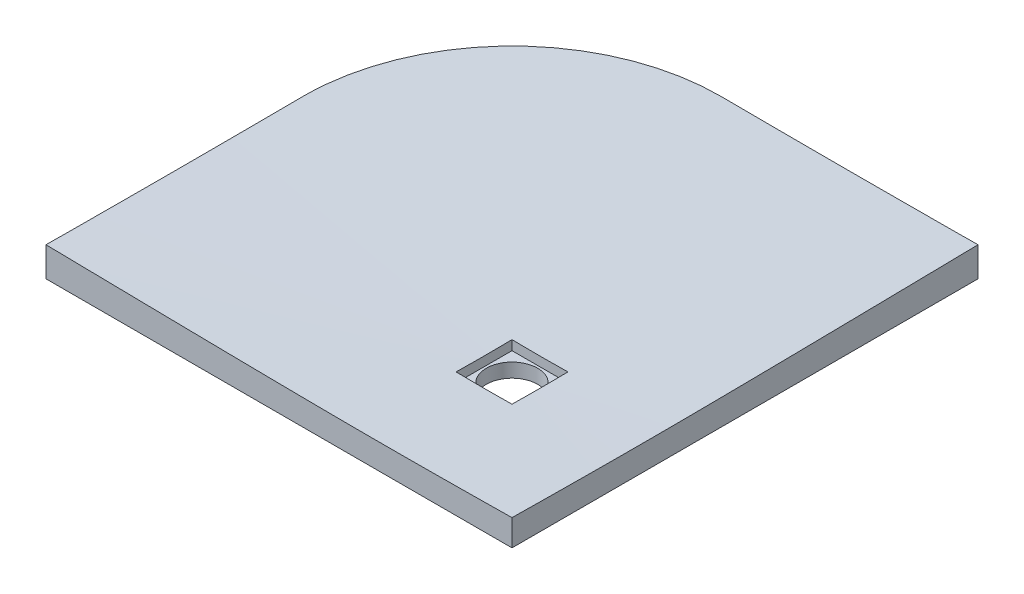
ISO-10303-21;
HEADER;
FILE_DESCRIPTION(('STEP AP214'),'2;1');
FILE_NAME('part.step','',(''),(''),'','','');
FILE_SCHEMA(('AUTOMOTIVE_DESIGN { 1 0 10303 214 1 1 1 1 }'));
ENDSEC;
DATA;
#1=APPLICATION_CONTEXT('core data for automotive mechanical design processes');
#2=APPLICATION_PROTOCOL_DEFINITION('international standard','automotive_design',2000,#1);
#3=PRODUCT_CONTEXT('',#1,'mechanical');
#4=PRODUCT('Part','Part','',(#3));
#5=PRODUCT_RELATED_PRODUCT_CATEGORY('part','',(#4));
#6=PRODUCT_DEFINITION_FORMATION('','',#4);
#7=PRODUCT_DEFINITION_CONTEXT('part definition',#1,'design');
#8=PRODUCT_DEFINITION('design','',#6,#7);
#9=PRODUCT_DEFINITION_SHAPE('','',#8);
#10=(LENGTH_UNIT() NAMED_UNIT(*) SI_UNIT(.MILLI.,.METRE.));
#11=(NAMED_UNIT(*) PLANE_ANGLE_UNIT() SI_UNIT($,.RADIAN.));
#12=(NAMED_UNIT(*) SI_UNIT($,.STERADIAN.) SOLID_ANGLE_UNIT());
#13=UNCERTAINTY_MEASURE_WITH_UNIT(LENGTH_MEASURE(1.E-05),#10,'distance_accuracy_value','');
#14=(GEOMETRIC_REPRESENTATION_CONTEXT(3) GLOBAL_UNCERTAINTY_ASSIGNED_CONTEXT((#13)) GLOBAL_UNIT_ASSIGNED_CONTEXT((#10,
#11,#12)) REPRESENTATION_CONTEXT('',''));
#15=CARTESIAN_POINT('',(0.,0.,0.));
#16=DIRECTION('',(0.,0.,1.));
#17=DIRECTION('',(1.,0.,0.));
#18=AXIS2_PLACEMENT_3D('',#15,#16,#17);
#19=CARTESIAN_POINT('',(223.5,-70.,223.5));
#20=DIRECTION('',(0.,1.,0.));
#21=DIRECTION('',(0.,0.,1.));
#22=AXIS2_PLACEMENT_3D('',#19,#20,#21);
#23=CYLINDRICAL_SURFACE('',#22,55.0000000000001);
#24=CARTESIAN_POINT('',(223.5,-70.,223.5));
#25=DIRECTION('',(0.,1.,0.));
#26=DIRECTION('',(0.,0.,1.));
#27=AXIS2_PLACEMENT_3D('',#24,#25,#26);
#28=CIRCLE('',#27,55.0000000000001);
#29=CARTESIAN_POINT('',(223.5,-70.,278.5));
#30=VERTEX_POINT('',#29);
#31=EDGE_CURVE('E177',#30,#30,#28,.T.);
#32=ORIENTED_EDGE('',*,*,#31,.F.);
#33=EDGE_LOOP('',(#32));
#34=FACE_BOUND('',#33,.T.);
#35=CARTESIAN_POINT('',(223.5,-40.,223.5));
#36=DIRECTION('',(0.,1.,0.));
#37=DIRECTION('',(0.,0.,1.));
#38=AXIS2_PLACEMENT_3D('',#35,#36,#37);
#39=CIRCLE('',#38,55.0000000000001);
#40=CARTESIAN_POINT('',(223.5,-40.,278.5));
#41=VERTEX_POINT('',#40);
#42=EDGE_CURVE('E67',#41,#41,#39,.F.);
#43=ORIENTED_EDGE('',*,*,#42,.F.);
#44=EDGE_LOOP('',(#43));
#45=FACE_BOUND('',#44,.T.);
#46=ADVANCED_FACE('F62',(#34,#45),#23,.F.);
#47=CARTESIAN_POINT('',(268.892086228115,-20.,254.557342253634));
#48=CARTESIAN_POINT('',(793.797325696511,0.,1200.38604865162));
#49=CARTESIAN_POINT('',(331.006770735383,-20.,163.773169797404));
#50=CARTESIAN_POINT('',(2747.56942299976,0.,59.7913972586013));
#51=CARTESIAN_POINT('',(240.222598279153,-20.,101.658485290136));
#52=CARTESIAN_POINT('',(1606.97477160673,0.,-1893.98070004464));
#53=CARTESIAN_POINT('',(178.107913771885,-20.,192.442657746366));
#54=CARTESIAN_POINT('',(-346.797325696511,0.,-753.386048651623));
#55=CARTESIAN_POINT('',(115.993229264616,-20.,283.226830202596));
#56=CARTESIAN_POINT('',(-2300.56942299976,0.,387.208602741399));
#57=CARTESIAN_POINT('',(206.777401720846,-20.,345.341514709864));
#58=CARTESIAN_POINT('',(-1159.97477160673,0.,2340.98070004465));
#59=CARTESIAN_POINT('',(268.892086228115,-20.,254.557342253634));
#60=CARTESIAN_POINT('',(793.797325696511,0.,1200.38604865162));
#61=(BOUNDED_SURFACE() B_SPLINE_SURFACE(3,1,((#47,#48),(#49,#50),(#51,#52),(#53,#54),(#55,#56),
(#57,#58),(#59,#60)),.UNSPECIFIED.,.T.,.F.,.F.) B_SPLINE_SURFACE_WITH_KNOTS((4,3,4),(2,2),(0.,
0.5,1.),(0.,1.),.UNSPECIFIED.) GEOMETRIC_REPRESENTATION_ITEM() RATIONAL_B_SPLINE_SURFACE(((1.,
1.),(0.333333333333333,0.333333333333333),(0.333333333333333,0.333333333333333),(1.,1.),
(0.333333333333333,0.333333333333333),(0.333333333333333,0.333333333333333),(1.,1.))) REPRESENTATION_ITEM('') SURFACE());
#62=CARTESIAN_POINT('',(500.,-6.5961327024955,-500.));
#63=CARTESIAN_POINT('',(486.112062479628,-6.68785544661228,-500.));
#64=CARTESIAN_POINT('',(472.224084380555,-6.77352997391001,-500.));
#65=CARTESIAN_POINT('',(444.448051283156,-6.93215513674839,-500.));
#66=CARTESIAN_POINT('',(430.559996284806,-7.00510576832152,-500.));
#67=CARTESIAN_POINT('',(402.783821204437,-7.13765562887392,-500.));
#68=CARTESIAN_POINT('',(388.895701122413,-7.19725485679232,-500.));
#69=CARTESIAN_POINT('',(361.119414194405,-7.30257320450082,-500.));
#70=CARTESIAN_POINT('',(347.231247348445,-7.3482923302907,-500.));
#71=CARTESIAN_POINT('',(319.454875024604,-7.42542208353765,-500.));
#72=CARTESIAN_POINT('',(305.566669546727,-7.45683271226499,-500.));
#73=CARTESIAN_POINT('',(277.790233703281,-7.50504175919853,-500.));
#74=CARTESIAN_POINT('',(263.902003337713,-7.52184017798842,-500.));
#75=CARTESIAN_POINT('',(236.125514443605,-7.5406586477661,-500.));
#76=CARTESIAN_POINT('',(222.237255915052,-7.54267867947611,-500.));
#77=CARTESIAN_POINT('',(194.460743949835,-7.53192020342901,-500.));
#78=CARTESIAN_POINT('',(180.572490513172,-7.5191416949685,-500.));
#79=CARTESIAN_POINT('',(152.796005033548,-7.47891292460756,-500.));
#80=CARTESIAN_POINT('',(138.907772990586,-7.45146266278969,-500.));
#81=CARTESIAN_POINT('',(111.131349915833,-7.38215803046327,-500.));
#82=CARTESIAN_POINT('',(97.2431588840283,-7.34030366508078,-500.));
#83=CARTESIAN_POINT('',(69.4668262477322,-7.24258604962675,-500.));
#84=CARTESIAN_POINT('',(55.5786846432405,-7.18672279959748,-500.));
#85=CARTESIAN_POINT('',(27.8024628477503,-7.06149421164214,-500.));
#86=CARTESIAN_POINT('',(13.9143826567512,-6.99212887388099,-500.));
#87=CARTESIAN_POINT('',(-20.8086634654984,-6.8025596210081,-500.));
#88=CARTESIAN_POINT('',(-41.643585640806,-6.67428166754999,-500.));
#89=CARTESIAN_POINT('',(-83.3132496020889,-6.39093430234656,-500.));
#90=CARTESIAN_POINT('',(-104.147991388034,-6.23586488624339,-500.));
#91=CARTESIAN_POINT('',(-145.817296838781,-5.9013836292213,-500.));
#92=CARTESIAN_POINT('',(-166.651860503412,-5.72197176716899,-500.));
#93=CARTESIAN_POINT('',(-208.320785646058,-5.34127657340688,-500.));
#94=CARTESIAN_POINT('',(-229.155147124088,-5.13999324324065,-500.));
#95=CARTESIAN_POINT('',(-270.824026507449,-4.71794226011168,-500.));
#96=CARTESIAN_POINT('',(-291.658544409411,-4.49717427571121,-500.));
#97=CARTESIAN_POINT('',(-333.327390737754,-4.0383902056845,-500.));
#98=CARTESIAN_POINT('',(-354.161719164127,-3.80037411924085,-500.));
#99=CARTESIAN_POINT('',(-395.830138028814,-3.30914963445154,-500.));
#100=CARTESIAN_POINT('',(-416.664228467631,-3.0559412785943,-500.));
#101=CARTESIAN_POINT('',(-458.332238322209,-2.53612154640275,-500.));
#102=CARTESIAN_POINT('',(-479.166157738002,-2.26951017264693,-500.));
#103=CARTESIAN_POINT('',(-500.,-1.99709218737515,-500.));
#104=B_SPLINE_CURVE_WITH_KNOTS('',3,(#62,#63,#64,#65,#66,#67,#68,#69,#70,#71,#72,#73,#74,#75,
#76,#77,#78,#79,#80,#81,#82,#83,#84,#85,#86,#87,#88,#89,#90,#91,#92,#93,#94,#95,#96,#97,#98,#99,
#100,#101,#102,#103),.UNSPECIFIED.,.F.,.F.,(4,2,2,2,2,2,2,2,2,2,2,2,2,2,2,2,2,2,2,2,4),(0.,
41.6647208466389,83.3294546849827,124.994191833922,166.65891097295,208.323626413104,
249.98834018897,291.653108314682,333.317878420784,374.982648292427,416.647403336603,
458.312158255073,499.9769126647,562.482843746727,624.988784995853,687.49478051116,
750.000771615146,812.507826163146,875.014883673431,937.52176637757,1000.02863705666),.UNSPECIFIED.);
#105=CARTESIAN_POINT('',(500.,-6.59613270249551,-500.));
#106=VERTEX_POINT('',#105);
#107=CARTESIAN_POINT('',(-50.0000000000001,-6.61584997746518,-500.));
#108=VERTEX_POINT('',#107);
#109=EDGE_CURVE('E208',#106,#108,#104,.T.);
#110=CARTESIAN_POINT('',(-50.0000000000001,-6.61584997746518,-500.));
#111=CARTESIAN_POINT('',(-55.06260158378,-6.58273501174328,-500.000034933978));
#112=CARTESIAN_POINT('',(-60.1252055384841,-6.55029406279531,-499.914568170665));
#113=CARTESIAN_POINT('',(-70.2444762815154,-6.48677044496971,-499.572887232423));
#114=CARTESIAN_POINT('',(-75.3011432751197,-6.45568772769815,-499.316679146319));
#115=CARTESIAN_POINT('',(-85.4028349335683,-6.39488920987209,-498.633779971366));
#116=CARTESIAN_POINT('',(-90.4478598837391,-6.36517337547229,-498.207093106266));
#117=CARTESIAN_POINT('',(-100.520579838768,-6.30711679741774,-497.183739421377));
#118=CARTESIAN_POINT('',(-105.5482750753,-6.27877603531348,-496.587074882936));
#119=CARTESIAN_POINT('',(-115.580663777321,-6.22347748126596,-495.224441174464));
#120=CARTESIAN_POINT('',(-120.585357306527,-6.19651968548967,-494.458472473707));
#121=CARTESIAN_POINT('',(-130.562330511011,-6.14401440715907,-492.758736828345));
#122=CARTESIAN_POINT('',(-135.534631592992,-6.11846588690056,-491.82509556309));
#123=CARTESIAN_POINT('',(-145.44489843853,-6.06876505357561,-489.790699275938));
#124=CARTESIAN_POINT('',(-150.382864455693,-6.04461273018687,-488.689945489748));
#125=CARTESIAN_POINT('',(-160.218848626718,-5.99771123540863,-486.322579247339));
#126=CARTESIAN_POINT('',(-165.116867017365,-5.97496205569688,-485.055967774986));
#127=CARTESIAN_POINT('',(-174.867414249558,-5.9308732930352,-482.358318909765));
#128=CARTESIAN_POINT('',(-179.719943266431,-5.90953370465042,-480.927282150915));
#129=CARTESIAN_POINT('',(-189.373935162143,-5.86827050299761,-477.902435891193));
#130=CARTESIAN_POINT('',(-194.175398165612,-5.84834688627311,-476.30862678768));
#131=CARTESIAN_POINT('',(-204.918085724326,-5.8051062214585,-472.54041342721));
#132=CARTESIAN_POINT('',(-210.84344459463,-5.78218976247117,-470.320596287162));
#133=CARTESIAN_POINT('',(-222.595301680342,-5.73859050969902,-465.633112049985));
#134=CARTESIAN_POINT('',(-228.421798660678,-5.71790774380225,-463.165441859108));
#135=CARTESIAN_POINT('',(-239.965628331097,-5.67878501335832,-457.986616918299));
#136=CARTESIAN_POINT('',(-245.682960460781,-5.66034506032207,-455.275460918835));
#137=CARTESIAN_POINT('',(-256.998221117414,-5.62571656889605,-449.614510445444));
#138=CARTESIAN_POINT('',(-262.596149901187,-5.60952802566334,-446.664716484864));
#139=CARTESIAN_POINT('',(-273.661682886603,-5.57941226651617,-440.53227495536));
#140=CARTESIAN_POINT('',(-279.129310035683,-5.56548464988095,-437.349668794834));
#141=CARTESIAN_POINT('',(-289.925546933905,-5.53989357658352,-430.756795930757));
#142=CARTESIAN_POINT('',(-295.254156876802,-5.52823011676553,-427.346529544527));
#143=CARTESIAN_POINT('',(-305.762842025034,-5.50717266480503,-420.3044363556));
#144=CARTESIAN_POINT('',(-310.942917630921,-5.49777866654199,-416.672610150465));
#145=CARTESIAN_POINT('',(-321.145458249822,-5.48126423089666,-409.193741358283));
#146=CARTESIAN_POINT('',(-326.167923896625,-5.47414378437081,-405.346699636844));
#147=CARTESIAN_POINT('',(-334.399514445991,-5.46417406765516,-398.761664753653));
#148=CARTESIAN_POINT('',(-337.655039004325,-5.46069223135664,-396.081433570761));
#149=CARTESIAN_POINT('',(-344.089589376675,-5.45474094924068,-390.63043275296));
#150=CARTESIAN_POINT('',(-347.268613594351,-5.45227152453212,-387.859661231575));
#151=CARTESIAN_POINT('',(-353.547433409457,-5.44834581469543,-382.229942972749));
#152=CARTESIAN_POINT('',(-356.647231053113,-5.44688950337556,-379.370998516814));
#153=CARTESIAN_POINT('',(-362.765377822925,-5.44499014369742,-373.566992386915));
#154=CARTESIAN_POINT('',(-365.783723576732,-5.44454713722955,-370.621927157785));
#155=CARTESIAN_POINT('',(-371.736310779589,-5.44467460345533,-364.648256145626));
#156=CARTESIAN_POINT('',(-374.67055596852,-5.44524503101115,-361.619654089198));
#157=CARTESIAN_POINT('',(-380.45291365821,-5.44739921686328,-355.481018041599));
#158=CARTESIAN_POINT('',(-383.30102171698,-5.44898302732555,-352.37097986624));
#159=CARTESIAN_POINT('',(-388.909258654441,-5.4531641300154,-346.071447576609));
#160=CARTESIAN_POINT('',(-391.66936977912,-5.45576162537894,-342.881937656715));
#161=CARTESIAN_POINT('',(-397.098693247655,-5.46196940272479,-336.426749792724));
#162=CARTESIAN_POINT('',(-399.767910261836,-5.46557963258244,-333.161075776664));
#163=CARTESIAN_POINT('',(-405.013601567374,-5.47381239552588,-326.555835334449));
#164=CARTESIAN_POINT('',(-407.590071746877,-5.47843497342907,-323.216265642763));
#165=CARTESIAN_POINT('',(-412.648000740029,-5.48869118672747,-316.466158510891));
#166=CARTESIAN_POINT('',(-415.129463479124,-5.49432478029546,-313.055624011782));
#167=CARTESIAN_POINT('',(-419.995570210028,-5.5066021485126,-306.166086670194));
#168=CARTESIAN_POINT('',(-422.380212971499,-5.51324593599369,-302.687082958476));
#169=CARTESIAN_POINT('',(-427.050672747719,-5.52754197738791,-295.663544140621));
#170=CARTESIAN_POINT('',(-429.336491821608,-5.5351942102751,-292.119010402101));
#171=CARTESIAN_POINT('',(-434.925960399851,-5.55558610046338,-283.178108540559));
#172=CARTESIAN_POINT('',(-438.166809861966,-5.56895588472096,-277.742304420074));
#173=CARTESIAN_POINT('',(-444.416352982836,-5.59795626763484,-266.738958662938));
#174=CARTESIAN_POINT('',(-447.425044946505,-5.61358688279608,-261.171416064792));
#175=CARTESIAN_POINT('',(-453.205085748106,-5.64710262448058,-249.914212270592));
#176=CARTESIAN_POINT('',(-455.976427320812,-5.66498781997448,-244.224547343071));
#177=CARTESIAN_POINT('',(-461.276850860536,-5.70300521043832,-232.733115136418));
#178=CARTESIAN_POINT('',(-463.805919686127,-5.72313752716913,-226.93134179676));
#179=CARTESIAN_POINT('',(-468.615888633616,-5.76562826066695,-215.229341281261));
#180=CARTESIAN_POINT('',(-470.896916629306,-5.78798551890288,-209.329166661693));
#181=CARTESIAN_POINT('',(-475.208223213807,-5.83492445992442,-197.437996397026));
#182=CARTESIAN_POINT('',(-477.238505289001,-5.85950611177372,-191.447002015989));
#183=CARTESIAN_POINT('',(-481.044511772319,-5.91087966139981,-179.385534109951));
#184=CARTESIAN_POINT('',(-482.820266694446,-5.93767129362523,-173.315070207544));
#185=CARTESIAN_POINT('',(-486.114014713631,-5.9934498288681,-161.105949748447));
#186=CARTESIAN_POINT('',(-487.632066332274,-6.02243623130956,-154.967309012226));
#187=CARTESIAN_POINT('',(-489.932164834719,-6.07228003808278,-144.746775271615));
#188=CARTESIAN_POINT('',(-490.788103239196,-6.09251697514288,-140.681346461202));
#189=CARTESIAN_POINT('',(-492.386962435937,-6.13392806551867,-132.528940099889));
#190=CARTESIAN_POINT('',(-493.129901280489,-6.15510206843382,-128.441966099115));
#191=CARTESIAN_POINT('',(-494.502261681678,-6.19838350992598,-120.249470356394));
#192=CARTESIAN_POINT('',(-495.13169524126,-6.22049084949911,-116.143950622742));
#193=CARTESIAN_POINT('',(-496.276635660864,-6.26563566163323,-107.917274578168));
#194=CARTESIAN_POINT('',(-496.79214846272,-6.28867308560907,-103.79611909418));
#195=CARTESIAN_POINT('',(-497.708240064756,-6.33564117127325,-95.546998227434));
#196=CARTESIAN_POINT('',(-498.108981394959,-6.35957051504238,-91.4190508839363));
#197=CARTESIAN_POINT('',(-498.796221508302,-6.40834987790933,-83.1534440799192));
#198=CARTESIAN_POINT('',(-499.082714296122,-6.43319994524838,-79.0157841211768));
#199=CARTESIAN_POINT('',(-499.541228166182,-6.48381744157124,-70.7336885743915));
#200=CARTESIAN_POINT('',(-499.713237008224,-6.50958496833623,-66.5892523093225));
#201=CARTESIAN_POINT('',(-499.942640069533,-6.56203405445096,-58.2965436621694));
#202=CARTESIAN_POINT('',(-500.000015739813,-6.58871576101532,-54.1482707679032));
#203=CARTESIAN_POINT('',(-500.,-6.61584997746517,-50.0000000000001));
#204=B_SPLINE_CURVE_WITH_KNOTS('',3,(#110,#111,#112,#113,#114,#115,#116,#117,#118,#119,#120,
#121,#122,#123,#124,#125,#126,#127,#128,#129,#130,#131,#132,#133,#134,#135,#136,#137,#138,#139,
#140,#141,#142,#143,#144,#145,#146,#147,#148,#149,#150,#151,#152,#153,#154,#155,#156,#157,#158,
#159,#160,#161,#162,#163,#164,#165,#166,#167,#168,#169,#170,#171,#172,#173,#174,#175,#176,#177,
#178,#179,#180,#181,#182,#183,#184,#185,#186,#187,#188,#189,#190,#191,#192,#193,#194,#195,#196,
#197,#198,#199,#200,#201,#202,#203),.UNSPECIFIED.,.F.,.F.,(4,2,2,2,2,2,2,2,2,2,2,2,2,2,2,2,2,2,
2,2,2,2,2,2,2,2,2,2,2,2,2,2,2,2,2,2,2,2,2,2,2,2,2,2,2,2,4),(0.,15.1874053448454,
30.3742691189307,45.5607566494679,60.7470403647433,75.933281987379,91.1081878792439,
106.282981566464,121.457685241143,136.63233040461,151.806938524721,170.783780169788,
189.760858716728,208.738034656701,227.715169774831,246.6889377539,265.662679287078,
284.63636964908,303.609983703437,316.259115111576,328.908510241966,341.557578338762,
354.207169343153,366.856196955416,379.505875754656,392.158090771007,404.809654707014,
417.461778850466,430.113379677394,442.765141224042,455.41663902501,474.396483822631,
493.376467187523,512.357031316681,531.338624412626,550.310384964915,569.281881703214,
588.251102136746,607.216009089806,619.67838593233,632.138769747184,644.597835128899,
657.056250522134,669.496935085143,681.938272401042,694.380939684988,706.825620174909),.UNSPECIFIED.);
#205=CARTESIAN_POINT('',(-500.,-6.61584997746518,-50.));
#206=VERTEX_POINT('',#205);
#207=EDGE_CURVE('E241',#108,#206,#204,.T.);
#208=CARTESIAN_POINT('',(-500.,-1.99709218737516,-500.));
#209=CARTESIAN_POINT('',(-500.,-2.26947325969159,-479.168981922455));
#210=CARTESIAN_POINT('',(-500.,-2.53604927452685,-458.33788671214));
#211=CARTESIAN_POINT('',(-500.,-3.05580216145944,-416.675525318168));
#212=CARTESIAN_POINT('',(-500.,-3.30897903098038,-395.844259134478));
#213=CARTESIAN_POINT('',(-500.,-3.80014517980666,-354.181488871637));
#214=CARTESIAN_POINT('',(-500.,-4.03813441665965,-333.349984791982));
#215=CARTESIAN_POINT('',(-500.,-4.49687033149219,-291.686787211909));
#216=CARTESIAN_POINT('',(-500.,-4.71761701028836,-270.855093711499));
#217=CARTESIAN_POINT('',(-500.,-5.1396357180801,-229.191488096841));
#218=CARTESIAN_POINT('',(-500.,-5.34090772779136,-208.359575982398));
#219=CARTESIAN_POINT('',(-500.,-5.72158703443854,-166.69554961471));
#220=CARTESIAN_POINT('',(-500.,-5.90099432983193,-145.863435361451));
#221=CARTESIAN_POINT('',(-500.,-6.23547410397321,-104.199028755587));
#222=CARTESIAN_POINT('',(-500.,-6.39054660382984,-83.3667364031524));
#223=CARTESIAN_POINT('',(-500.,-6.67390857781212,-41.7019713345925));
#224=CARTESIAN_POINT('',(-500.,-6.80219805629228,-20.8694986184973));
#225=CARTESIAN_POINT('',(-500.,-6.9918110634202,13.8525873936767));
#226=CARTESIAN_POINT('',(-500.,-7.06120322808978,27.7421569513649));
#227=CARTESIAN_POINT('',(-500.,-7.18648335280699,55.5213575087397));
#228=CARTESIAN_POINT('',(-500.,-7.24237131268928,69.4109885084271));
#229=CARTESIAN_POINT('',(-500.,-7.34013593351407,97.1902999623208));
#230=CARTESIAN_POINT('',(-500.,-7.38201259441413,111.079980416527));
#231=CARTESIAN_POINT('',(-500.,-7.45135912583788,138.859382357566));
#232=CARTESIAN_POINT('',(-500.,-7.4788289912384,152.749103844411));
#233=CARTESIAN_POINT('',(-500.,-7.51909403585394,180.528568232969));
#234=CARTESIAN_POINT('',(-500.,-7.53188921498645,194.418311134683));
#235=CARTESIAN_POINT('',(-500.,-7.54267790841317,222.197802046475));
#236=CARTESIAN_POINT('',(-500.,-7.54067142341112,236.087550056554));
#237=CARTESIAN_POINT('',(-500.,-7.52187642847218,263.867554820985));
#238=CARTESIAN_POINT('',(-500.,-7.50508736643255,277.757811574964));
#239=CARTESIAN_POINT('',(-500.,-7.45689259232997,305.538300199241));
#240=CARTESIAN_POINT('',(-500.,-7.42548687968269,319.428532069539));
#241=CARTESIAN_POINT('',(-500.,-7.34836256471025,347.208957175289));
#242=CARTESIAN_POINT('',(-500.,-7.30264396111389,361.099150410737));
#243=CARTESIAN_POINT('',(-500.,-7.197322393173,388.879490125012));
#244=CARTESIAN_POINT('',(-500.,-7.13771942281025,402.769636603816));
#245=CARTESIAN_POINT('',(-500.,-7.00515800952977,430.549864461373));
#246=CARTESIAN_POINT('',(-500.,-6.93219956767361,444.439945840132));
#247=CARTESIAN_POINT('',(-500.,-6.77355497834194,472.220031676168));
#248=CARTESIAN_POINT('',(-500.,-6.68786883483657,486.110036133468));
#249=CARTESIAN_POINT('',(-500.,-6.59613270249551,500.));
#250=B_SPLINE_CURVE_WITH_KNOTS('',3,(#208,#209,#210,#211,#212,#213,#214,#215,#216,#217,#218,
#219,#220,#221,#222,#223,#224,#225,#226,#227,#228,#229,#230,#231,#232,#233,#234,#235,#236,#237,
#238,#239,#240,#241,#242,#243,#244,#245,#246,#247,#248,#249),.UNSPECIFIED.,.F.,.F.,(4,2,2,2,2,2,
2,2,2,2,2,2,2,2,2,2,2,2,2,2,4),(0.,62.4983974013246,124.996806819863,187.49539092583,
249.993972071815,312.49261510484,374.991262547086,437.48985577581,499.988438843193,
541.657661697737,583.326885062407,624.99610855325,666.665346861956,708.334585404957,
750.003821966793,791.674614865892,833.345409430906,875.016207696945,916.68702402528,
958.357837041358,1000.02863705912),.UNSPECIFIED.);
#251=CARTESIAN_POINT('',(-500.,-6.59613270249551,500.));
#252=VERTEX_POINT('',#251);
#253=EDGE_CURVE('E189',#206,#252,#250,.T.);
#254=CARTESIAN_POINT('',(-500.,-6.59613270249551,500.));
#255=CARTESIAN_POINT('',(-486.113803827184,-6.83606825198291,500.));
#256=CARTESIAN_POINT('',(-472.227592884788,-7.07515207360837,500.));
#257=CARTESIAN_POINT('',(-444.455092634061,-7.55127560567285,500.));
#258=CARTESIAN_POINT('',(-430.568803325621,-7.78831530973296,500.));
#259=CARTESIAN_POINT('',(-402.796150818211,-8.26000901612994,500.));
#260=CARTESIAN_POINT('',(-388.909787619145,-8.49466301273869,500.));
#261=CARTESIAN_POINT('',(-361.136990154856,-8.96114366040029,500.));
#262=CARTESIAN_POINT('',(-347.250555889553,-9.1929703066598,500.));
#263=CARTESIAN_POINT('',(-319.477617395344,-9.65325290863748,500.));
#264=CARTESIAN_POINT('',(-305.591113166381,-9.88170886094556,500.));
#265=CARTESIAN_POINT('',(-277.818033504937,-10.3345677781118,500.));
#266=CARTESIAN_POINT('',(-263.931458072433,-10.5589707414986,500.));
#267=CARTESIAN_POINT('',(-236.157824311378,-11.0028689174273,500.));
#268=CARTESIAN_POINT('',(-222.270765980539,-11.222363986914,500.));
#269=CARTESIAN_POINT('',(-194.496562332876,-11.6553439298828,500.));
#270=CARTESIAN_POINT('',(-180.609417016099,-11.8688288063457,500.));
#271=CARTESIAN_POINT('',(-152.835025282384,-12.2883865154772,500.));
#272=CARTESIAN_POINT('',(-138.947778865536,-12.4944593540869,500.));
#273=CARTESIAN_POINT('',(-111.173164959112,-12.8973942430981,500.));
#274=CARTESIAN_POINT('',(-97.2857974696629,-13.0942563021478,500.));
#275=CARTESIAN_POINT('',(-69.5109142431812,-13.4764615147131,500.));
#276=CARTESIAN_POINT('',(-55.6233985062727,-13.6618046771977,500.));
#277=CARTESIAN_POINT('',(-27.8481814899162,-14.0180431494244,500.));
#278=CARTESIAN_POINT('',(-13.9604802104883,-14.1889384607266,500.));
#279=CARTESIAN_POINT('',(6.87176866283769,-14.4316911973248,500.));
#280=CARTESIAN_POINT('',(13.8162372213196,-14.5103465257554,500.));
#281=CARTESIAN_POINT('',(27.7052309906719,-14.6625863753071,500.));
#282=CARTESIAN_POINT('',(34.6497562015494,-14.7361708957896,500.));
#283=CARTESIAN_POINT('',(48.5388646630074,-14.8777011059324,500.));
#284=CARTESIAN_POINT('',(55.4834479135916,-14.945646795241,500.));
#285=CARTESIAN_POINT('',(69.3726541062203,-15.0752928209125,500.));
#286=CARTESIAN_POINT('',(76.3172770481068,-15.1369931741613,500.));
#287=CARTESIAN_POINT('',(90.2065808280047,-15.2535208392913,500.));
#288=CARTESIAN_POINT('',(97.1512616660159,-15.3083481512072,500.));
#289=CARTESIAN_POINT('',(111.040678522443,-15.4105006643687,500.));
#290=CARTESIAN_POINT('',(117.98541454086,-15.4578258656065,500.));
#291=CARTESIAN_POINT('',(135.347397246076,-15.5659949574583,500.));
#292=CARTESIAN_POINT('',(145.764676211671,-15.6217665122443,500.));
#293=CARTESIAN_POINT('',(166.599323004911,-15.713231024596,500.));
#294=CARTESIAN_POINT('',(177.016690832557,-15.7489239821039,500.));
#295=CARTESIAN_POINT('',(197.851473639463,-15.798941683076,500.));
#296=CARTESIAN_POINT('',(208.2688886187,-15.8132664365649,500.));
#297=CARTESIAN_POINT('',(229.10372387363,-15.8199982712989,500.));
#298=CARTESIAN_POINT('',(239.52114414932,-15.8124053564446,500.));
#299=CARTESIAN_POINT('',(260.355871579054,-15.7755955276067,500.));
#300=CARTESIAN_POINT('',(270.773178733372,-15.7463787681255,500.));
#301=CARTESIAN_POINT('',(291.607712028326,-15.6674026406164,500.));
#302=CARTESIAN_POINT('',(302.024938168977,-15.6176432769412,500.));
#303=CARTESIAN_POINT('',(322.859275301809,-15.4992624554573,500.));
#304=CARTESIAN_POINT('',(333.276386294061,-15.4306410100105,500.));
#305=CARTESIAN_POINT('',(354.11048291931,-15.2765638993322,500.));
#306=CARTESIAN_POINT('',(364.527468552304,-15.1911082336539,500.));
#307=CARTESIAN_POINT('',(385.365915436884,-15.0054598724959,500.));
#308=CARTESIAN_POINT('',(395.7873766301,-14.9052606753347,500.));
#309=CARTESIAN_POINT('',(416.630170244672,-14.6922192812505,500.));
#310=CARTESIAN_POINT('',(427.051502666013,-14.5793770828495,500.));
#311=CARTESIAN_POINT('',(447.89409632479,-14.3429525476893,500.));
#312=CARTESIAN_POINT('',(458.315357561621,-14.2193701579371,500.));
#313=CARTESIAN_POINT('',(479.157762772698,-13.9630761847766,500.));
#314=CARTESIAN_POINT('',(489.578906747,-13.8303646059564,500.));
#315=CARTESIAN_POINT('',(500.,-13.6938936029717,500.));
#316=B_SPLINE_CURVE_WITH_KNOTS('',3,(#254,#255,#256,#257,#258,#259,#260,#261,#262,#263,#264,
#265,#266,#267,#268,#269,#270,#271,#272,#273,#274,#275,#276,#277,#278,#279,#280,#281,#282,#283,
#284,#285,#286,#287,#288,#289,#290,#291,#292,#293,#294,#295,#296,#297,#298,#299,#300,#301,#302,
#303,#304,#305,#306,#307,#308,#309,#310,#311,#312,#313,#314,#315),.UNSPECIFIED.,.F.,.F.,(4,2,2,
2,2,2,2,2,2,2,2,2,2,2,2,2,2,2,2,2,2,2,2,2,2,2,2,2,2,2,4),(0.,41.664806771968,83.3297435168735,
124.994780276524,166.65988766333,208.325037199433,249.990201861434,291.656579400335,
333.322936273955,374.989259748592,416.65554410052,458.321796009373,499.988043419504,
520.822783859798,541.657526924285,562.492271288611,583.326959319188,604.161647244691,
624.996335191777,656.248601426914,687.500867751986,718.753119415403,750.005365516972,
781.257388323391,812.509404507832,843.761400210543,875.013396742924,906.279216482799,
937.545039877898,968.811017550159,1000.07697950882),.UNSPECIFIED.);
#317=CARTESIAN_POINT('',(500.,-13.6938936029717,500.));
#318=VERTEX_POINT('',#317);
#319=EDGE_CURVE('E181',#252,#318,#316,.T.);
#320=CARTESIAN_POINT('',(500.,-13.6938936029717,500.));
#321=CARTESIAN_POINT('',(500.,-13.8302704152685,489.586106187956));
#322=CARTESIAN_POINT('',(500.,-13.9628928770026,479.17216172519));
#323=CARTESIAN_POINT('',(500.,-14.2190223158387,458.344155731829));
#324=CARTESIAN_POINT('',(500.,-14.3425292883847,447.930094201179));
#325=CARTESIAN_POINT('',(500.,-14.5788217099107,427.101770784442));
#326=CARTESIAN_POINT('',(500.,-14.6916070786521,416.687508897439));
#327=CARTESIAN_POINT('',(500.,-14.9045560224422,395.858856578149));
#328=CARTESIAN_POINT('',(500.,-15.0047195990175,385.444466145878));
#329=CARTESIAN_POINT('',(500.,-15.190363880944,364.615523455072));
#330=CARTESIAN_POINT('',(500.,-15.2758445440546,354.200971196157));
#331=CARTESIAN_POINT('',(500.,-15.429985510465,333.371740910598));
#332=CARTESIAN_POINT('',(500.,-15.4986458135793,322.957062883953));
#333=CARTESIAN_POINT('',(500.,-15.6171201872761,302.127629416096));
#334=CARTESIAN_POINT('',(500.,-15.6669343135407,291.712873975204));
#335=CARTESIAN_POINT('',(500.,-15.7460303384704,270.883283995927));
#336=CARTESIAN_POINT('',(500.,-15.7753122378977,260.468449457545));
#337=CARTESIAN_POINT('',(500.,-15.8061196681092,243.110329336782));
#338=CARTESIAN_POINT('',(500.,-15.8136437520558,236.167053925265));
#339=CARTESIAN_POINT('',(500.,-15.8189772526813,222.280498807735));
#340=CARTESIAN_POINT('',(500.,-15.8167866689178,215.337219101721));
#341=CARTESIAN_POINT('',(500.,-15.8027253387419,201.450669924086));
#342=CARTESIAN_POINT('',(500.,-15.7908545927743,194.507400452464));
#343=CARTESIAN_POINT('',(500.,-15.7576344459958,180.620879360908));
#344=CARTESIAN_POINT('',(500.,-15.7362850384357,173.67762774099));
#345=CARTESIAN_POINT('',(500.,-15.6844541865079,159.791158527955));
#346=CARTESIAN_POINT('',(500.,-15.6539727418678,152.847940934838));
#347=CARTESIAN_POINT('',(500.,-15.5843453057395,138.961549610544));
#348=CARTESIAN_POINT('',(500.,-15.5451993143363,132.018375879365));
#349=CARTESIAN_POINT('',(500.,-15.4371922270433,114.660516850353));
#350=CARTESIAN_POINT('',(500.,-15.3632600597276,104.245862931772));
#351=CARTESIAN_POINT('',(500.,-15.1992133292279,83.4166782986395));
#352=CARTESIAN_POINT('',(500.,-15.1090987569848,73.00214758416));
#353=CARTESIAN_POINT('',(500.,-14.914819793337,52.1732106723938));
#354=CARTESIAN_POINT('',(500.,-14.8106553920243,41.7588044752001));
#355=CARTESIAN_POINT('',(500.,-14.5902957651385,20.9301196138781));
#356=CARTESIAN_POINT('',(500.,-14.4741005389594,10.5158409497564));
#357=CARTESIAN_POINT('',(500.,-14.2314985071473,-10.3126845183726));
#358=CARTESIAN_POINT('',(500.,-14.1050916156121,-20.7269313213746));
#359=CARTESIAN_POINT('',(500.,-13.8436524457959,-41.5553104545898));
#360=CARTESIAN_POINT('',(500.,-13.7086201723172,-51.9694427848635));
#361=CARTESIAN_POINT('',(500.,-13.4312809653033,-72.7976084766057));
#362=CARTESIAN_POINT('',(500.,-13.2889740330384,-83.2116418380912));
#363=CARTESIAN_POINT('',(500.,-12.9982188885431,-104.039622137609));
#364=CARTESIAN_POINT('',(500.,-12.8497706765936,-114.453569075646));
#365=CARTESIAN_POINT('',(500.,-12.5173534892482,-137.372413697924));
#366=CARTESIAN_POINT('',(500.,-12.3322372705859,-149.877294720949));
#367=CARTESIAN_POINT('',(500.,-11.955855603835,-174.88696449394));
#368=CARTESIAN_POINT('',(500.,-11.7645901554977,-187.391753243901));
#369=CARTESIAN_POINT('',(500.,-11.3769724542466,-212.401253683133));
#370=CARTESIAN_POINT('',(500.,-11.180620200562,-224.905965372392));
#371=CARTESIAN_POINT('',(500.,-10.7836807714383,-249.915323499408));
#372=CARTESIAN_POINT('',(500.,-10.5830935953045,-262.419969937155));
#373=CARTESIAN_POINT('',(500.,-10.1783686456267,-287.429206742988));
#374=CARTESIAN_POINT('',(500.,-9.97423087167218,-299.933797111067));
#375=CARTESIAN_POINT('',(500.,-9.56296364618254,-324.942576467226));
#376=CARTESIAN_POINT('',(500.,-9.35583427903542,-337.446765456696));
#377=CARTESIAN_POINT('',(500.,-8.93902818323254,-362.45509989009));
#378=CARTESIAN_POINT('',(500.,-8.72935145479304,-374.959245334019));
#379=CARTESIAN_POINT('',(500.,-8.30781816983489,-399.967496406112));
#380=CARTESIAN_POINT('',(500.,-8.09596161384864,-412.471602034285));
#381=CARTESIAN_POINT('',(500.,-7.67037437910904,-437.479776148124));
#382=CARTESIAN_POINT('',(500.,-7.45664370113957,-449.983844633804));
#383=CARTESIAN_POINT('',(500.,-7.02755102884366,-474.991946089951));
#384=CARTESIAN_POINT('',(500.,-6.81218903549941,-487.495979060436));
#385=CARTESIAN_POINT('',(500.,-6.5961327024955,-500.));
#386=B_SPLINE_CURVE_WITH_KNOTS('',3,(#320,#321,#322,#323,#324,#325,#326,#327,#328,#329,#330,
#331,#332,#333,#334,#335,#336,#337,#338,#339,#340,#341,#342,#343,#344,#345,#346,#347,#348,#349,
#350,#351,#352,#353,#354,#355,#356,#357,#358,#359,#360,#361,#362,#363,#364,#365,#366,#367,#368,
#369,#370,#371,#372,#373,#374,#375,#376,#377,#378,#379,#380,#381,#382,#383,#384,#385),
.UNSPECIFIED.,.F.,.F.,(4,2,2,2,2,2,2,2,2,2,2,2,2,2,2,2,2,2,2,2,2,2,2,2,2,2,2,2,2,2,2,2,4),(0.,
31.2443617826566,62.4887391817975,93.7333503898745,124.977957818945,156.222655132678,
187.467352790872,218.711958133811,249.95656231653,270.786394570406,291.616227772858,
312.446060018242,333.275907095628,354.105754794299,374.935602288633,406.180335908939,
437.42508702032,468.669860166119,499.914634885538,531.159672468367,562.404692655212,
593.649707385808,624.894720686997,662.413472168659,699.932225167509,737.450983852377,
774.969748693694,812.488517874813,850.006230771825,887.523940483847,925.04164103307,
962.559325890789,1000.07698816145),.UNSPECIFIED.);
#387=EDGE_CURVE('E215',#318,#106,#386,.T.);
#388=CARTESIAN_POINT('',(283.5,-19.4079700716115,283.5));
#389=CARTESIAN_POINT('',(283.5,-19.4420993727579,281.000474651997));
#390=CARTESIAN_POINT('',(283.5,-19.4752943818578,278.500936123536));
#391=CARTESIAN_POINT('',(283.5,-19.5392973340525,273.501826569102));
#392=CARTESIAN_POINT('',(283.5,-19.5701052752196,271.002255543105));
#393=CARTESIAN_POINT('',(283.5,-19.6288158920174,266.003050013013));
#394=CARTESIAN_POINT('',(283.5,-19.6567185340758,263.503415508518));
#395=CARTESIAN_POINT('',(283.5,-19.7089788098809,258.504110383739));
#396=CARTESIAN_POINT('',(283.5,-19.7333364443339,256.004439763463));
#397=CARTESIAN_POINT('',(283.5,-19.7999898901287,248.505341475571));
#398=CARTESIAN_POINT('',(283.5,-19.8358659427512,243.50585183949));
#399=CARTESIAN_POINT('',(283.5,-19.8725476621799,236.006546358047));
#400=CARTESIAN_POINT('',(283.5,-19.8819195070092,233.506771392147));
#401=CARTESIAN_POINT('',(283.5,-19.8944809945121,228.507206194649));
#402=CARTESIAN_POINT('',(283.5,-19.897670639275,226.007415963055));
#403=CARTESIAN_POINT('',(283.5,-19.8976837507131,221.007849358816));
#404=CARTESIAN_POINT('',(283.5,-19.8945072526219,218.50807298617));
#405=CARTESIAN_POINT('',(283.5,-19.8819700368377,213.508534844444));
#406=CARTESIAN_POINT('',(283.5,-19.8726093158925,211.008773075373));
#407=CARTESIAN_POINT('',(283.5,-19.8420684548175,204.758159786164));
#408=CARTESIAN_POINT('',(283.5,-19.8173175644542,201.007325661697));
#409=CARTESIAN_POINT('',(283.5,-19.7573493741068,193.505738408821));
#410=CARTESIAN_POINT('',(283.5,-19.7221320580034,189.754985280546));
#411=CARTESIAN_POINT('',(283.5,-19.6437323991355,182.253477030236));
#412=CARTESIAN_POINT('',(283.5,-19.6005498725726,178.502721910153));
#413=CARTESIAN_POINT('',(283.5,-19.5313506626584,172.876652355982));
#414=CARTESIAN_POINT('',(283.5,-19.5075467418855,171.00131014632));
#415=CARTESIAN_POINT('',(283.5,-19.4586642601283,167.250642847328));
#416=CARTESIAN_POINT('',(283.5,-19.4335856995046,165.375317757993));
#417=CARTESIAN_POINT('',(283.5,-19.4079700716115,163.5));
#418=B_SPLINE_CURVE_WITH_KNOTS('',3,(#388,#389,#390,#391,#392,#393,#394,#395,#396,#397,#398,
#399,#400,#401,#402,#403,#404,#405,#406,#407,#408,#409,#410,#411,#412,#413,#414,#415,#416,#417),
.UNSPECIFIED.,.F.,.F.,(4,2,2,2,2,2,2,2,2,2,2,2,2,2,4),(0.,7.49927544414957,14.9985569440605,
22.4979250922622,29.9972917462099,44.9960984351783,52.4954695851815,59.9948382007837,
67.494165311187,74.9934963654332,86.2462238394231,97.4989686439045,108.751973139525,
114.378452660752,120.004930590161),.UNSPECIFIED.);
#419=CARTESIAN_POINT('',(283.5,-19.4079700716115,283.5));
#420=VERTEX_POINT('',#419);
#421=CARTESIAN_POINT('',(283.5,-19.4079700716115,163.5));
#422=VERTEX_POINT('',#421);
#423=EDGE_CURVE('E13',#420,#422,#418,.T.);
#424=CARTESIAN_POINT('',(163.5,-19.4079700716115,283.5));
#425=CARTESIAN_POINT('',(165.999524864417,-19.4420993663222,283.5));
#426=CARTESIAN_POINT('',(168.49906290931,-19.4752943690993,283.5));
#427=CARTESIAN_POINT('',(173.498171450617,-19.539297309081,283.5));
#428=CARTESIAN_POINT('',(175.997741947055,-19.570105244402,283.5));
#429=CARTESIAN_POINT('',(180.996947429881,-19.628815863325,283.5));
#430=CARTESIAN_POINT('',(183.496582416682,-19.6567185121785,283.5));
#431=CARTESIAN_POINT('',(188.495888554713,-19.7089787989939,283.5));
#432=CARTESIAN_POINT('',(190.995559705937,-19.7333364375933,283.5));
#433=CARTESIAN_POINT('',(198.494659093667,-19.7999898992373,283.5));
#434=CARTESIAN_POINT('',(203.494149297587,-19.8358659730296,283.5));
#435=CARTESIAN_POINT('',(210.993454755528,-19.8725476552655,283.5));
#436=CARTESIAN_POINT('',(213.493229127019,-19.881919476064,283.5));
#437=CARTESIAN_POINT('',(218.492793748331,-19.8944810266183,283.5));
#438=CARTESIAN_POINT('',(220.992583998152,-19.8976707569216,283.5));
#439=CARTESIAN_POINT('',(225.992725327757,-19.8976836345471,283.5));
#440=CARTESIAN_POINT('',(228.493076407545,-19.8945053534047,283.5));
#441=CARTESIAN_POINT('',(233.493762747437,-19.8819632897162,283.5));
#442=CARTESIAN_POINT('',(235.994098007538,-19.8725995065236,283.5));
#443=CARTESIAN_POINT('',(243.495072604385,-19.8359366507261,283.5));
#444=CARTESIAN_POINT('',(248.495671065043,-19.8000660749731,283.5));
#445=CARTESIAN_POINT('',(255.996571113847,-19.7334112759052,283.5));
#446=CARTESIAN_POINT('',(258.496934696638,-19.7090507424875,283.5));
#447=CARTESIAN_POINT('',(263.497621574825,-19.656782165418,283.5));
#448=CARTESIAN_POINT('',(265.997944870274,-19.6288741269472,283.5));
#449=CARTESIAN_POINT('',(270.998573256543,-19.5701502422924,283.5));
#450=CARTESIAN_POINT('',(273.498878347135,-19.5393343770196,283.5));
#451=CARTESIAN_POINT('',(278.499460021264,-19.4753139736526,283.5));
#452=CARTESIAN_POINT('',(280.999736604776,-19.4421094336562,283.5));
#453=CARTESIAN_POINT('',(283.5,-19.4079700716115,283.5));
#454=B_SPLINE_CURVE_WITH_KNOTS('',3,(#424,#425,#426,#427,#428,#429,#430,#431,#432,#433,#434,
#435,#436,#437,#438,#439,#440,#441,#442,#443,#444,#445,#446,#447,#448,#449,#450,#451,#452,#453),
.UNSPECIFIED.,.F.,.F.,(4,2,2,2,2,2,2,2,2,2,2,2,2,2,4),(0.,7.49927399330288,14.9985539044207,
22.4979234997837,29.9972917462096,44.9961001441887,52.4954695045365,59.9948382007807,
67.4958893346856,74.9969412526713,89.9990741662403,97.5005196916759,105.001954262023,
112.503438080262,120.004927872507),.UNSPECIFIED.);
#455=CARTESIAN_POINT('',(163.5,-19.4079700716115,283.5));
#456=VERTEX_POINT('',#455);
#457=EDGE_CURVE('E260',#456,#420,#454,.T.);
#458=CARTESIAN_POINT('',(163.5,-19.4079700716115,163.5));
#459=CARTESIAN_POINT('',(163.5,-19.4420993406583,165.999522981761));
#460=CARTESIAN_POINT('',(163.5,-19.4752943191231,168.499059143978));
#461=CARTESIAN_POINT('',(163.5,-19.539297214426,173.498163917446));
#462=CARTESIAN_POINT('',(163.5,-19.5701051293827,175.997732528722));
#463=CARTESIAN_POINT('',(163.5,-19.6288157570837,180.996938009086));
#464=CARTESIAN_POINT('',(163.5,-19.6567184306996,183.49657487864));
#465=CARTESIAN_POINT('',(163.5,-19.7089787622673,188.495884784509));
#466=CARTESIAN_POINT('',(163.5,-19.7333364208533,190.995557820818));
#467=CARTESIAN_POINT('',(163.5,-19.7999899315641,198.494662734167));
#468=CARTESIAN_POINT('',(163.5,-19.8358660251409,203.494156578717));
#469=CARTESIAN_POINT('',(163.5,-19.872547691469,210.993463847385));
#470=CARTESIAN_POINT('',(163.5,-19.8819194987792,213.4932363889));
#471=CARTESIAN_POINT('',(163.5,-19.8944810312537,218.492797369602));
#472=CARTESIAN_POINT('',(163.5,-19.8976707569174,220.992585808787));
#473=CARTESIAN_POINT('',(163.5,-19.8976836345426,225.992720159564));
#474=CARTESIAN_POINT('',(163.5,-19.8945053665936,228.493066071158));
#475=CARTESIAN_POINT('',(163.5,-19.881963354466,233.493742015881));
#476=CARTESIAN_POINT('',(163.5,-19.8725996097866,235.994072049008));
#477=CARTESIAN_POINT('',(163.5,-19.8359367994622,243.49505181431));
#478=CARTESIAN_POINT('',(163.5,-19.8000661672089,248.495660670181));
#479=CARTESIAN_POINT('',(163.5,-19.7334110718928,255.996594079707));
#480=CARTESIAN_POINT('',(163.5,-19.7090502950915,258.496980627977));
#481=CARTESIAN_POINT('',(163.5,-19.6567811297774,263.49771753605));
#482=CARTESIAN_POINT('',(163.5,-19.6288727406287,265.998067895846));
#483=CARTESIAN_POINT('',(163.5,-19.5701486916362,270.998700312532));
#484=CARTESIAN_POINT('',(163.5,-19.5393330709622,273.498982369888));
#485=CARTESIAN_POINT('',(163.5,-19.4753132570169,278.499514014145));
#486=CARTESIAN_POINT('',(163.5,-19.4421090656305,280.99976360107));
#487=CARTESIAN_POINT('',(163.5,-19.4079700716115,283.5));
#488=B_SPLINE_CURVE_WITH_KNOTS('',3,(#458,#459,#460,#461,#462,#463,#464,#465,#466,#467,#468,
#469,#470,#471,#472,#473,#474,#475,#476,#477,#478,#479,#480,#481,#482,#483,#484,#485,#486,#487),
.UNSPECIFIED.,.F.,.F.,(4,2,2,2,2,2,2,2,2,2,2,2,2,2,4),(0.,7.499268344807,14.9985426001194,
22.4979178442116,29.9972917462085,44.9961110660985,52.4954749364201,59.9948382007635,
67.4958738300993,74.9969100668794,89.9990741661769,97.500588591845,105.00210436185,
112.50351907663,120.00492787243),.UNSPECIFIED.);
#489=CARTESIAN_POINT('',(163.5,-19.4079700716115,163.5));
#490=VERTEX_POINT('',#489);
#491=EDGE_CURVE('E269',#490,#456,#488,.T.);
#492=CARTESIAN_POINT('',(283.5,-19.4079700716115,163.5));
#493=CARTESIAN_POINT('',(281.000475135583,-19.4420993663222,163.5));
#494=CARTESIAN_POINT('',(278.500937090689,-19.4752943690993,163.5));
#495=CARTESIAN_POINT('',(273.501828549383,-19.539297309081,163.5));
#496=CARTESIAN_POINT('',(271.002258052945,-19.570105244402,163.5));
#497=CARTESIAN_POINT('',(266.003052570119,-19.628815863325,163.5));
#498=CARTESIAN_POINT('',(263.503417583318,-19.6567185121785,163.5));
#499=CARTESIAN_POINT('',(258.504111445287,-19.7089787989939,163.5));
#500=CARTESIAN_POINT('',(256.004440294063,-19.7333364375933,163.5));
#501=CARTESIAN_POINT('',(248.505340906333,-19.7999898992373,163.5));
#502=CARTESIAN_POINT('',(243.505850702412,-19.8358659730296,163.5));
#503=CARTESIAN_POINT('',(236.006545244472,-19.8725476552655,163.5));
#504=CARTESIAN_POINT('',(233.506770872981,-19.881919476064,163.5));
#505=CARTESIAN_POINT('',(228.507206251668,-19.8944810266183,163.5));
#506=CARTESIAN_POINT('',(226.007416001848,-19.8976707569216,163.5));
#507=CARTESIAN_POINT('',(221.007274672243,-19.8976836345471,163.5));
#508=CARTESIAN_POINT('',(218.506923592454,-19.8945053534047,163.5));
#509=CARTESIAN_POINT('',(213.506237252563,-19.8819632897162,163.5));
#510=CARTESIAN_POINT('',(211.005901992462,-19.8725995065236,163.5));
#511=CARTESIAN_POINT('',(203.504927395615,-19.8359366507262,163.5));
#512=CARTESIAN_POINT('',(198.504328934957,-19.8000660749731,163.5));
#513=CARTESIAN_POINT('',(191.003428886153,-19.7334112759052,163.5));
#514=CARTESIAN_POINT('',(188.503065303362,-19.7090507424875,163.5));
#515=CARTESIAN_POINT('',(183.502378425175,-19.656782165418,163.5));
#516=CARTESIAN_POINT('',(181.002055129726,-19.6288741269472,163.5));
#517=CARTESIAN_POINT('',(176.001426743457,-19.5701502422924,163.5));
#518=CARTESIAN_POINT('',(173.501121652865,-19.5393343770196,163.5));
#519=CARTESIAN_POINT('',(168.500539978736,-19.4753139736526,163.5));
#520=CARTESIAN_POINT('',(166.000263395223,-19.4421094336562,163.5));
#521=CARTESIAN_POINT('',(163.5,-19.4079700716115,163.5));
#522=B_SPLINE_CURVE_WITH_KNOTS('',3,(#492,#493,#494,#495,#496,#497,#498,#499,#500,#501,#502,
#503,#504,#505,#506,#507,#508,#509,#510,#511,#512,#513,#514,#515,#516,#517,#518,#519,#520,#521),
.UNSPECIFIED.,.F.,.F.,(4,2,2,2,2,2,2,2,2,2,2,2,2,2,4),(0.,7.49927399330282,14.9985539044206,
22.4979234997837,29.9972917462095,44.9961001441886,52.4954695045365,59.9948382007807,
67.4958893346856,74.9969412526714,89.9990741662404,97.5005196916759,105.001954262023,
112.503438080262,120.004927872507),.UNSPECIFIED.);
#523=EDGE_CURVE('E73',#422,#490,#522,.T.);
#524=ORIENTED_EDGE('',*,*,#109,.T.);
#525=ORIENTED_EDGE('',*,*,#207,.T.);
#526=ORIENTED_EDGE('',*,*,#253,.T.);
#527=ORIENTED_EDGE('',*,*,#319,.T.);
#528=ORIENTED_EDGE('',*,*,#387,.T.);
#529=EDGE_LOOP('',(#524,#525,#526,#527,#528));
#530=FACE_BOUND('',#529,.T.);
#531=ORIENTED_EDGE('',*,*,#423,.F.);
#532=ORIENTED_EDGE('',*,*,#457,.F.);
#533=ORIENTED_EDGE('',*,*,#491,.F.);
#534=ORIENTED_EDGE('',*,*,#523,.F.);
#535=EDGE_LOOP('',(#531,#532,#533,#534));
#536=FACE_BOUND('',#535,.T.);
#537=ADVANCED_FACE('F195',(#530,#536),#61,.F.);
#538=CARTESIAN_POINT('',(-50.0000000000002,0.,-50.0000000000001));
#539=DIRECTION('',(0.,1.,0.));
#540=DIRECTION('',(0.,0.,1.));
#541=AXIS2_PLACEMENT_3D('',#538,#539,#540);
#542=CYLINDRICAL_SURFACE('',#541,450.);
#543=DIRECTION('',(0.,1.,0.));
#544=VECTOR('',#543,1.);
#545=CARTESIAN_POINT('',(-50.0000000000002,0.,-500.));
#546=LINE('',#545,#544);
#547=CARTESIAN_POINT('',(-50.0000000000002,-70.,-500.));
#548=VERTEX_POINT('',#547);
#549=EDGE_CURVE('E257',#108,#548,#546,.F.);
#550=ORIENTED_EDGE('',*,*,#549,.T.);
#551=CARTESIAN_POINT('',(-50.0000000000002,-70.,-50.0000000000001));
#552=DIRECTION('',(0.,1.,0.));
#553=DIRECTION('',(0.,0.,1.));
#554=AXIS2_PLACEMENT_3D('',#551,#552,#553);
#555=CIRCLE('',#554,450.);
#556=CARTESIAN_POINT('',(-500.,-70.,-50.));
#557=VERTEX_POINT('',#556);
#558=EDGE_CURVE('E88',#557,#548,#555,.F.);
#559=ORIENTED_EDGE('',*,*,#558,.F.);
#560=DIRECTION('',(0.,1.,0.));
#561=VECTOR('',#560,1.);
#562=CARTESIAN_POINT('',(-500.,0.,-50.));
#563=LINE('',#562,#561);
#564=EDGE_CURVE('E256',#206,#557,#563,.F.);
#565=ORIENTED_EDGE('',*,*,#564,.F.);
#566=ORIENTED_EDGE('',*,*,#207,.F.);
#567=EDGE_LOOP('',(#550,#559,#565,#566));
#568=FACE_BOUND('',#567,.T.);
#569=ADVANCED_FACE('F64',(#568),#542,.T.);
#570=CARTESIAN_POINT('',(500.,-70.,-500.));
#571=DIRECTION('',(1.,0.,0.));
#572=DIRECTION('',(0.,0.,-1.));
#573=AXIS2_PLACEMENT_3D('',#570,#571,#572);
#574=PLANE('',#573);
#575=ORIENTED_EDGE('',*,*,#387,.F.);
#576=DIRECTION('',(0.,1.,0.));
#577=VECTOR('',#576,1.);
#578=CARTESIAN_POINT('',(500.,-70.,500.));
#579=LINE('',#578,#577);
#580=CARTESIAN_POINT('',(500.,-70.,500.));
#581=VERTEX_POINT('',#580);
#582=EDGE_CURVE('E237',#581,#318,#579,.T.);
#583=ORIENTED_EDGE('',*,*,#582,.F.);
#584=DIRECTION('',(0.,0.,-1.));
#585=VECTOR('',#584,1.);
#586=CARTESIAN_POINT('',(500.,-70.,-500.));
#587=LINE('',#586,#585);
#588=CARTESIAN_POINT('',(500.,-70.,-500.));
#589=VERTEX_POINT('',#588);
#590=EDGE_CURVE('E221',#581,#589,#587,.T.);
#591=ORIENTED_EDGE('',*,*,#590,.T.);
#592=DIRECTION('',(0.,1.,0.));
#593=VECTOR('',#592,1.);
#594=CARTESIAN_POINT('',(500.,-70.,-500.));
#595=LINE('',#594,#593);
#596=EDGE_CURVE('E236',#589,#106,#595,.T.);
#597=ORIENTED_EDGE('',*,*,#596,.T.);
#598=EDGE_LOOP('',(#575,#583,#591,#597));
#599=FACE_BOUND('',#598,.T.);
#600=ADVANCED_FACE('F304',(#599),#574,.T.);
#601=CARTESIAN_POINT('',(-500.,-70.,500.));
#602=DIRECTION('',(0.,0.,1.));
#603=DIRECTION('',(1.,0.,0.));
#604=AXIS2_PLACEMENT_3D('',#601,#602,#603);
#605=PLANE('',#604);
#606=ORIENTED_EDGE('',*,*,#319,.F.);
#607=DIRECTION('',(0.,1.,0.));
#608=VECTOR('',#607,1.);
#609=CARTESIAN_POINT('',(-500.,-70.,500.));
#610=LINE('',#609,#608);
#611=CARTESIAN_POINT('',(-500.,-70.,500.));
#612=VERTEX_POINT('',#611);
#613=EDGE_CURVE('E242',#612,#252,#610,.T.);
#614=ORIENTED_EDGE('',*,*,#613,.F.);
#615=DIRECTION('',(1.,0.,0.));
#616=VECTOR('',#615,1.);
#617=CARTESIAN_POINT('',(-500.,-70.,500.));
#618=LINE('',#617,#616);
#619=EDGE_CURVE('E232',#612,#581,#618,.T.);
#620=ORIENTED_EDGE('',*,*,#619,.T.);
#621=ORIENTED_EDGE('',*,*,#582,.T.);
#622=EDGE_LOOP('',(#606,#614,#620,#621));
#623=FACE_BOUND('',#622,.T.);
#624=ADVANCED_FACE('F320',(#623),#605,.T.);
#625=CARTESIAN_POINT('',(-500.,-70.,-500.));
#626=DIRECTION('',(-1.,0.,0.));
#627=DIRECTION('',(0.,0.,1.));
#628=AXIS2_PLACEMENT_3D('',#625,#626,#627);
#629=PLANE('',#628);
#630=ORIENTED_EDGE('',*,*,#253,.F.);
#631=ORIENTED_EDGE('',*,*,#564,.T.);
#632=DIRECTION('',(0.,0.,1.));
#633=VECTOR('',#632,1.);
#634=CARTESIAN_POINT('',(-500.,-70.,-500.));
#635=LINE('',#634,#633);
#636=EDGE_CURVE('E229',#557,#612,#635,.T.);
#637=ORIENTED_EDGE('',*,*,#636,.T.);
#638=ORIENTED_EDGE('',*,*,#613,.T.);
#639=EDGE_LOOP('',(#630,#631,#637,#638));
#640=FACE_BOUND('',#639,.T.);
#641=ADVANCED_FACE('F323',(#640),#629,.T.);
#642=CARTESIAN_POINT('',(-500.,-70.,-500.));
#643=DIRECTION('',(0.,0.,-1.));
#644=DIRECTION('',(-1.,0.,0.));
#645=AXIS2_PLACEMENT_3D('',#642,#643,#644);
#646=PLANE('',#645);
#647=ORIENTED_EDGE('',*,*,#549,.F.);
#648=ORIENTED_EDGE('',*,*,#109,.F.);
#649=ORIENTED_EDGE('',*,*,#596,.F.);
#650=DIRECTION('',(-1.,0.,0.));
#651=VECTOR('',#650,1.);
#652=CARTESIAN_POINT('',(-500.,-70.,-500.));
#653=LINE('',#652,#651);
#654=EDGE_CURVE('E225',#589,#548,#653,.T.);
#655=ORIENTED_EDGE('',*,*,#654,.T.);
#656=EDGE_LOOP('',(#647,#648,#649,#655));
#657=FACE_BOUND('',#656,.T.);
#658=ADVANCED_FACE('F313',(#657),#646,.T.);
#659=CARTESIAN_POINT('',(0.,-70.,0.));
#660=DIRECTION('',(0.,1.,0.));
#661=DIRECTION('',(0.,0.,1.));
#662=AXIS2_PLACEMENT_3D('',#659,#660,#661);
#663=PLANE('',#662);
#664=ORIENTED_EDGE('',*,*,#31,.T.);
#665=EDGE_LOOP('',(#664));
#666=FACE_BOUND('',#665,.T.);
#667=ORIENTED_EDGE('',*,*,#636,.F.);
#668=ORIENTED_EDGE('',*,*,#558,.T.);
#669=ORIENTED_EDGE('',*,*,#654,.F.);
#670=ORIENTED_EDGE('',*,*,#590,.F.);
#671=ORIENTED_EDGE('',*,*,#619,.F.);
#672=EDGE_LOOP('',(#667,#668,#669,#670,#671));
#673=FACE_BOUND('',#672,.T.);
#674=ADVANCED_FACE('F306',(#666,#673),#663,.F.);
#675=CARTESIAN_POINT('',(0.,-40.,0.));
#676=DIRECTION('',(0.,1.,0.));
#677=DIRECTION('',(0.,0.,1.));
#678=AXIS2_PLACEMENT_3D('',#675,#676,#677);
#679=PLANE('',#678);
#680=DIRECTION('',(0.,0.,-1.));
#681=VECTOR('',#680,1.);
#682=CARTESIAN_POINT('',(283.5,-40.,163.5));
#683=LINE('',#682,#681);
#684=CARTESIAN_POINT('',(283.5,-40.,283.5));
#685=VERTEX_POINT('',#684);
#686=CARTESIAN_POINT('',(283.5,-40.,163.5));
#687=VERTEX_POINT('',#686);
#688=EDGE_CURVE('E142',#685,#687,#683,.T.);
#689=ORIENTED_EDGE('',*,*,#688,.T.);
#690=DIRECTION('',(-1.,0.,0.));
#691=VECTOR('',#690,1.);
#692=CARTESIAN_POINT('',(163.5,-40.,163.5));
#693=LINE('',#692,#691);
#694=CARTESIAN_POINT('',(163.5,-40.,163.5));
#695=VERTEX_POINT('',#694);
#696=EDGE_CURVE('E151',#687,#695,#693,.T.);
#697=ORIENTED_EDGE('',*,*,#696,.T.);
#698=DIRECTION('',(0.,0.,1.));
#699=VECTOR('',#698,1.);
#700=CARTESIAN_POINT('',(163.5,-40.,163.5));
#701=LINE('',#700,#699);
#702=CARTESIAN_POINT('',(163.5,-40.,283.5));
#703=VERTEX_POINT('',#702);
#704=EDGE_CURVE('E158',#695,#703,#701,.T.);
#705=ORIENTED_EDGE('',*,*,#704,.T.);
#706=DIRECTION('',(1.,0.,0.));
#707=VECTOR('',#706,1.);
#708=CARTESIAN_POINT('',(163.5,-40.,283.5));
#709=LINE('',#708,#707);
#710=EDGE_CURVE('E162',#703,#685,#709,.T.);
#711=ORIENTED_EDGE('',*,*,#710,.T.);
#712=EDGE_LOOP('',(#689,#697,#705,#711));
#713=FACE_BOUND('',#712,.T.);
#714=ORIENTED_EDGE('',*,*,#42,.T.);
#715=EDGE_LOOP('',(#714));
#716=FACE_BOUND('',#715,.T.);
#717=ADVANCED_FACE('F160',(#713,#716),#679,.T.);
#718=CARTESIAN_POINT('',(283.5,50.,163.5));
#719=DIRECTION('',(-1.,0.,0.));
#720=DIRECTION('',(0.,0.,1.));
#721=AXIS2_PLACEMENT_3D('',#718,#719,#720);
#722=PLANE('',#721);
#723=ORIENTED_EDGE('',*,*,#423,.T.);
#724=DIRECTION('',(0.,-1.,0.));
#725=VECTOR('',#724,1.);
#726=CARTESIAN_POINT('',(283.5,50.,163.5));
#727=LINE('',#726,#725);
#728=EDGE_CURVE('E137',#422,#687,#727,.T.);
#729=ORIENTED_EDGE('',*,*,#728,.T.);
#730=ORIENTED_EDGE('',*,*,#688,.F.);
#731=DIRECTION('',(0.,-1.,0.));
#732=VECTOR('',#731,1.);
#733=CARTESIAN_POINT('',(283.5,50.,283.5));
#734=LINE('',#733,#732);
#735=EDGE_CURVE('E171',#420,#685,#734,.T.);
#736=ORIENTED_EDGE('',*,*,#735,.F.);
#737=EDGE_LOOP('',(#723,#729,#730,#736));
#738=FACE_BOUND('',#737,.T.);
#739=ADVANCED_FACE('F139',(#738),#722,.T.);
#740=CARTESIAN_POINT('',(163.5,50.,163.5));
#741=DIRECTION('',(0.,0.,1.));
#742=DIRECTION('',(1.,0.,0.));
#743=AXIS2_PLACEMENT_3D('',#740,#741,#742);
#744=PLANE('',#743);
#745=ORIENTED_EDGE('',*,*,#523,.T.);
#746=DIRECTION('',(0.,-1.,0.));
#747=VECTOR('',#746,1.);
#748=CARTESIAN_POINT('',(163.5,50.,163.5));
#749=LINE('',#748,#747);
#750=EDGE_CURVE('E148',#490,#695,#749,.T.);
#751=ORIENTED_EDGE('',*,*,#750,.T.);
#752=ORIENTED_EDGE('',*,*,#696,.F.);
#753=ORIENTED_EDGE('',*,*,#728,.F.);
#754=EDGE_LOOP('',(#745,#751,#752,#753));
#755=FACE_BOUND('',#754,.T.);
#756=ADVANCED_FACE('F152',(#755),#744,.T.);
#757=CARTESIAN_POINT('',(163.5,50.,163.5));
#758=DIRECTION('',(1.,0.,0.));
#759=DIRECTION('',(0.,0.,-1.));
#760=AXIS2_PLACEMENT_3D('',#757,#758,#759);
#761=PLANE('',#760);
#762=ORIENTED_EDGE('',*,*,#491,.T.);
#763=DIRECTION('',(0.,-1.,0.));
#764=VECTOR('',#763,1.);
#765=CARTESIAN_POINT('',(163.5,50.,283.5));
#766=LINE('',#765,#764);
#767=EDGE_CURVE('E80',#456,#703,#766,.T.);
#768=ORIENTED_EDGE('',*,*,#767,.T.);
#769=ORIENTED_EDGE('',*,*,#704,.F.);
#770=ORIENTED_EDGE('',*,*,#750,.F.);
#771=EDGE_LOOP('',(#762,#768,#769,#770));
#772=FACE_BOUND('',#771,.T.);
#773=ADVANCED_FACE('F279',(#772),#761,.T.);
#774=CARTESIAN_POINT('',(163.5,50.,283.5));
#775=DIRECTION('',(0.,0.,-1.));
#776=DIRECTION('',(-1.,0.,0.));
#777=AXIS2_PLACEMENT_3D('',#774,#775,#776);
#778=PLANE('',#777);
#779=ORIENTED_EDGE('',*,*,#457,.T.);
#780=ORIENTED_EDGE('',*,*,#735,.T.);
#781=ORIENTED_EDGE('',*,*,#710,.F.);
#782=ORIENTED_EDGE('',*,*,#767,.F.);
#783=EDGE_LOOP('',(#779,#780,#781,#782));
#784=FACE_BOUND('',#783,.T.);
#785=ADVANCED_FACE('F275',(#784),#778,.T.);
#786=CLOSED_SHELL('',(#46,#537,#569,#600,#624,#641,#658,#674,#717,#739,#756,#773,#785));
#787=MANIFOLD_SOLID_BREP('B2',#786);
#788=ADVANCED_BREP_SHAPE_REPRESENTATION('',(#18,#787),#14);
#789=SHAPE_DEFINITION_REPRESENTATION(#9,#788);
ENDSEC;
END-ISO-10303-21;
